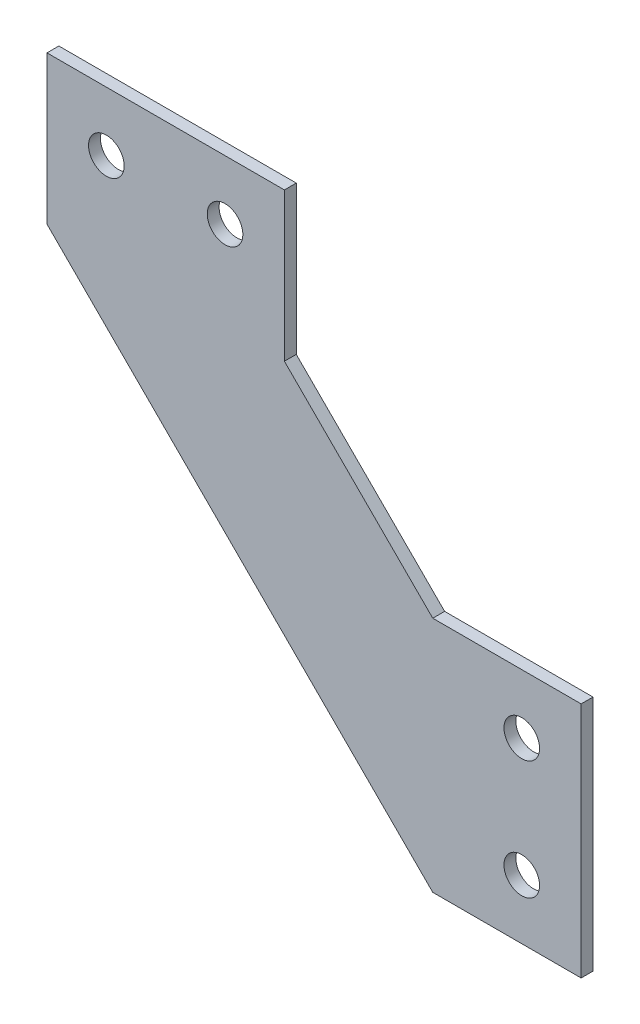
ISO-10303-21;
HEADER;
FILE_DESCRIPTION(('STEP AP214'),'2;1');
FILE_NAME('part.step','',(''),(''),'','','');
FILE_SCHEMA(('AUTOMOTIVE_DESIGN { 1 0 10303 214 1 1 1 1 }'));
ENDSEC;
DATA;
#1=APPLICATION_CONTEXT('core data for automotive mechanical design processes');
#2=APPLICATION_PROTOCOL_DEFINITION('international standard','automotive_design',2000,#1);
#3=PRODUCT_CONTEXT('',#1,'mechanical');
#4=PRODUCT('Part','Part','',(#3));
#5=PRODUCT_RELATED_PRODUCT_CATEGORY('part','',(#4));
#6=PRODUCT_DEFINITION_FORMATION('','',#4);
#7=PRODUCT_DEFINITION_CONTEXT('part definition',#1,'design');
#8=PRODUCT_DEFINITION('design','',#6,#7);
#9=PRODUCT_DEFINITION_SHAPE('','',#8);
#10=(LENGTH_UNIT() NAMED_UNIT(*) SI_UNIT(.MILLI.,.METRE.));
#11=(NAMED_UNIT(*) PLANE_ANGLE_UNIT() SI_UNIT($,.RADIAN.));
#12=(NAMED_UNIT(*) SI_UNIT($,.STERADIAN.) SOLID_ANGLE_UNIT());
#13=UNCERTAINTY_MEASURE_WITH_UNIT(LENGTH_MEASURE(1.E-05),#10,'distance_accuracy_value','');
#14=(GEOMETRIC_REPRESENTATION_CONTEXT(3) GLOBAL_UNCERTAINTY_ASSIGNED_CONTEXT((#13)) GLOBAL_UNIT_ASSIGNED_CONTEXT((#10,
#11,#12)) REPRESENTATION_CONTEXT('',''));
#15=CARTESIAN_POINT('',(0.,0.,0.));
#16=DIRECTION('',(0.,0.,1.));
#17=DIRECTION('',(1.,0.,0.));
#18=AXIS2_PLACEMENT_3D('',#15,#16,#17);
#19=CARTESIAN_POINT('',(0.,-1.7842570444233E-13,57.2993949770653));
#20=DIRECTION('',(0.,0.,-1.));
#21=DIRECTION('',(0.,1.,0.));
#22=AXIS2_PLACEMENT_3D('',#19,#20,#21);
#23=PLANE('',#22);
#24=CARTESIAN_POINT('',(-132.035137501078,-15.4498738995503,57.2993949770652));
#25=DIRECTION('',(0.,0.,-1.));
#26=DIRECTION('',(0.,1.,0.));
#27=AXIS2_PLACEMENT_3D('',#24,#25,#26);
#28=CIRCLE('',#27,3.00000000000005);
#29=CARTESIAN_POINT('',(-132.035137501078,-12.4498738995502,57.2993949770652));
#30=VERTEX_POINT('',#29);
#31=EDGE_CURVE('E192',#30,#30,#28,.T.);
#32=ORIENTED_EDGE('',*,*,#31,.F.);
#33=EDGE_LOOP('',(#32));
#34=FACE_BOUND('',#33,.T.);
#35=CARTESIAN_POINT('',(-202.035137501079,54.5501261004499,57.2993949770655));
#36=DIRECTION('',(0.,0.,-1.));
#37=DIRECTION('',(0.,1.,0.));
#38=AXIS2_PLACEMENT_3D('',#35,#36,#37);
#39=CIRCLE('',#38,2.99999999999628);
#40=CARTESIAN_POINT('',(-202.035137501079,57.5501261004462,57.2993949770655));
#41=VERTEX_POINT('',#40);
#42=EDGE_CURVE('E139',#41,#41,#39,.T.);
#43=ORIENTED_EDGE('',*,*,#42,.F.);
#44=EDGE_LOOP('',(#43));
#45=FACE_BOUND('',#44,.T.);
#46=DIRECTION('',(0.,1.,0.));
#47=VECTOR('',#46,1.);
#48=CARTESIAN_POINT('',(-212.035137501076,64.5501261004493,57.2993949770655));
#49=LINE('',#48,#47);
#50=CARTESIAN_POINT('',(-212.035137501076,39.5501261004506,57.2993949770654));
#51=VERTEX_POINT('',#50);
#52=CARTESIAN_POINT('',(-212.035137501076,64.5501261004493,57.2993949770655));
#53=VERTEX_POINT('',#52);
#54=EDGE_CURVE('E51',#51,#53,#49,.T.);
#55=ORIENTED_EDGE('',*,*,#54,.T.);
#56=DIRECTION('',(1.,0.,0.));
#57=VECTOR('',#56,1.);
#58=CARTESIAN_POINT('',(-212.035137501076,64.5501261004493,57.2993949770655));
#59=LINE('',#58,#57);
#60=CARTESIAN_POINT('',(-172.035137501077,64.5501261004493,57.2993949770655));
#61=VERTEX_POINT('',#60);
#62=EDGE_CURVE('E94',#53,#61,#59,.T.);
#63=ORIENTED_EDGE('',*,*,#62,.T.);
#64=DIRECTION('',(0.,-1.,0.));
#65=VECTOR('',#64,1.);
#66=CARTESIAN_POINT('',(-172.035137501077,64.5501261004493,57.2993949770655));
#67=LINE('',#66,#65);
#68=CARTESIAN_POINT('',(-172.035137501077,39.5501261004506,57.2993949770654));
#69=VERTEX_POINT('',#68);
#70=EDGE_CURVE('E164',#61,#69,#67,.T.);
#71=ORIENTED_EDGE('',*,*,#70,.T.);
#72=DIRECTION('',(0.707106781186529,-0.707106781186566,0.));
#73=VECTOR('',#72,1.);
#74=CARTESIAN_POINT('',(-172.035137501077,39.5501261004506,57.2993949770654));
#75=LINE('',#74,#73);
#76=CARTESIAN_POINT('',(-147.035137501078,14.5501261004497,57.2993949770653));
#77=VERTEX_POINT('',#76);
#78=EDGE_CURVE('E177',#69,#77,#75,.T.);
#79=ORIENTED_EDGE('',*,*,#78,.T.);
#80=DIRECTION('',(1.,0.,0.));
#81=VECTOR('',#80,1.);
#82=CARTESIAN_POINT('',(-147.035137501078,14.5501261004497,57.2993949770653));
#83=LINE('',#82,#81);
#84=CARTESIAN_POINT('',(-122.035137501077,14.5501261004497,57.2993949770653));
#85=VERTEX_POINT('',#84);
#86=EDGE_CURVE('E114',#77,#85,#83,.T.);
#87=ORIENTED_EDGE('',*,*,#86,.T.);
#88=DIRECTION('',(0.,-1.,0.));
#89=VECTOR('',#88,1.);
#90=CARTESIAN_POINT('',(-122.035137501077,-25.4498738995503,57.2993949770652));
#91=LINE('',#90,#89);
#92=CARTESIAN_POINT('',(-122.035137501077,-25.4498738995503,57.2993949770652));
#93=VERTEX_POINT('',#92);
#94=EDGE_CURVE('E108',#85,#93,#91,.T.);
#95=ORIENTED_EDGE('',*,*,#94,.T.);
#96=DIRECTION('',(-1.,0.,0.));
#97=VECTOR('',#96,1.);
#98=CARTESIAN_POINT('',(-122.035137501077,-25.4498738995503,57.2993949770652));
#99=LINE('',#98,#97);
#100=CARTESIAN_POINT('',(-147.035137501078,-25.4498738995503,57.2993949770652));
#101=VERTEX_POINT('',#100);
#102=EDGE_CURVE('E112',#93,#101,#99,.T.);
#103=ORIENTED_EDGE('',*,*,#102,.T.);
#104=DIRECTION('',(-0.70710678118653,0.707106781186565,0.));
#105=VECTOR('',#104,1.);
#106=CARTESIAN_POINT('',(-212.035137501076,39.5501261004506,57.2993949770654));
#107=LINE('',#106,#105);
#108=EDGE_CURVE('E129',#101,#51,#107,.T.);
#109=ORIENTED_EDGE('',*,*,#108,.T.);
#110=EDGE_LOOP('',(#55,#63,#71,#79,#87,#95,#103,#109));
#111=FACE_BOUND('',#110,.T.);
#112=CARTESIAN_POINT('',(-182.035137501078,54.5501261004499,57.2993949770655));
#113=DIRECTION('',(0.,0.,-1.));
#114=DIRECTION('',(0.,1.,0.));
#115=AXIS2_PLACEMENT_3D('',#112,#113,#114);
#116=CIRCLE('',#115,2.99999999999599);
#117=CARTESIAN_POINT('',(-182.035137501078,57.5501261004459,57.2993949770655));
#118=VERTEX_POINT('',#117);
#119=EDGE_CURVE('E186',#118,#118,#116,.T.);
#120=ORIENTED_EDGE('',*,*,#119,.F.);
#121=EDGE_LOOP('',(#120));
#122=FACE_BOUND('',#121,.T.);
#123=CARTESIAN_POINT('',(-132.035137501078,4.5501261004497,57.2993949770653));
#124=DIRECTION('',(0.,0.,-1.));
#125=DIRECTION('',(0.,1.,0.));
#126=AXIS2_PLACEMENT_3D('',#123,#124,#125);
#127=CIRCLE('',#126,2.99999999999999);
#128=CARTESIAN_POINT('',(-132.035137501078,7.55012610044969,57.2993949770653));
#129=VERTEX_POINT('',#128);
#130=EDGE_CURVE('E198',#129,#129,#127,.T.);
#131=ORIENTED_EDGE('',*,*,#130,.F.);
#132=EDGE_LOOP('',(#131));
#133=FACE_BOUND('',#132,.T.);
#134=ADVANCED_FACE('F34',(#34,#45,#111,#122,#133),#23,.T.);
#135=CARTESIAN_POINT('',(0.,-1.85162494640298E-13,59.2993949770653));
#136=DIRECTION('',(0.,0.,-1.));
#137=DIRECTION('',(0.,1.,0.));
#138=AXIS2_PLACEMENT_3D('',#135,#136,#137);
#139=PLANE('',#138);
#140=DIRECTION('',(1.,0.,0.));
#141=VECTOR('',#140,1.);
#142=CARTESIAN_POINT('',(-212.035137501076,64.5501261004493,59.2993949770655));
#143=LINE('',#142,#141);
#144=CARTESIAN_POINT('',(-212.035137501076,64.5501261004493,59.2993949770655));
#145=VERTEX_POINT('',#144);
#146=CARTESIAN_POINT('',(-172.035137501077,64.5501261004493,59.2993949770655));
#147=VERTEX_POINT('',#146);
#148=EDGE_CURVE('E135',#145,#147,#143,.T.);
#149=ORIENTED_EDGE('',*,*,#148,.F.);
#150=DIRECTION('',(0.,1.,0.));
#151=VECTOR('',#150,1.);
#152=CARTESIAN_POINT('',(-212.035137501076,44.5501261004506,59.2993949770654));
#153=LINE('',#152,#151);
#154=CARTESIAN_POINT('',(-212.035137501076,39.5501261004506,59.2993949770654));
#155=VERTEX_POINT('',#154);
#156=EDGE_CURVE('E149',#155,#145,#153,.T.);
#157=ORIENTED_EDGE('',*,*,#156,.F.);
#158=DIRECTION('',(-0.70710678118653,0.707106781186565,0.));
#159=VECTOR('',#158,1.);
#160=CARTESIAN_POINT('',(-212.035137501076,39.5501261004506,59.2993949770654));
#161=LINE('',#160,#159);
#162=CARTESIAN_POINT('',(-147.035137501078,-25.4498738995503,59.2993949770652));
#163=VERTEX_POINT('',#162);
#164=EDGE_CURVE('E87',#163,#155,#161,.T.);
#165=ORIENTED_EDGE('',*,*,#164,.F.);
#166=DIRECTION('',(-1.,0.,0.));
#167=VECTOR('',#166,1.);
#168=CARTESIAN_POINT('',(-142.035137501078,-25.4498738995503,59.2993949770652));
#169=LINE('',#168,#167);
#170=CARTESIAN_POINT('',(-122.035137501077,-25.4498738995503,59.2993949770652));
#171=VERTEX_POINT('',#170);
#172=EDGE_CURVE('E80',#171,#163,#169,.T.);
#173=ORIENTED_EDGE('',*,*,#172,.F.);
#174=DIRECTION('',(0.,-1.,0.));
#175=VECTOR('',#174,1.);
#176=CARTESIAN_POINT('',(-122.035137501077,-25.4498738995503,59.2993949770652));
#177=LINE('',#176,#175);
#178=CARTESIAN_POINT('',(-122.035137501077,14.5501261004497,59.2993949770653));
#179=VERTEX_POINT('',#178);
#180=EDGE_CURVE('E123',#179,#171,#177,.T.);
#181=ORIENTED_EDGE('',*,*,#180,.F.);
#182=DIRECTION('',(1.,0.,0.));
#183=VECTOR('',#182,1.);
#184=CARTESIAN_POINT('',(-122.035137501077,14.5501261004497,59.2993949770653));
#185=LINE('',#184,#183);
#186=CARTESIAN_POINT('',(-147.035137501078,14.5501261004497,59.2993949770653));
#187=VERTEX_POINT('',#186);
#188=EDGE_CURVE('E144',#187,#179,#185,.T.);
#189=ORIENTED_EDGE('',*,*,#188,.F.);
#190=DIRECTION('',(0.707106781186529,-0.707106781186566,0.));
#191=VECTOR('',#190,1.);
#192=CARTESIAN_POINT('',(-172.035137501077,39.5501261004506,59.2993949770654));
#193=LINE('',#192,#191);
#194=CARTESIAN_POINT('',(-172.035137501077,39.5501261004506,59.2993949770654));
#195=VERTEX_POINT('',#194);
#196=EDGE_CURVE('E141',#195,#187,#193,.T.);
#197=ORIENTED_EDGE('',*,*,#196,.F.);
#198=DIRECTION('',(0.,-1.,0.));
#199=VECTOR('',#198,1.);
#200=CARTESIAN_POINT('',(-172.035137501077,44.5501261004506,59.2993949770654));
#201=LINE('',#200,#199);
#202=EDGE_CURVE('E138',#147,#195,#201,.T.);
#203=ORIENTED_EDGE('',*,*,#202,.F.);
#204=EDGE_LOOP('',(#149,#157,#165,#173,#181,#189,#197,#203));
#205=FACE_BOUND('',#204,.T.);
#206=CARTESIAN_POINT('',(-202.035137501079,54.5501261004499,59.2993949770655));
#207=DIRECTION('',(0.,0.,-1.));
#208=DIRECTION('',(0.,1.,0.));
#209=AXIS2_PLACEMENT_3D('',#206,#207,#208);
#210=CIRCLE('',#209,2.99999999999628);
#211=CARTESIAN_POINT('',(-202.035137501079,57.5501261004462,59.2993949770655));
#212=VERTEX_POINT('',#211);
#213=EDGE_CURVE('E183',#212,#212,#210,.T.);
#214=ORIENTED_EDGE('',*,*,#213,.T.);
#215=EDGE_LOOP('',(#214));
#216=FACE_BOUND('',#215,.T.);
#217=CARTESIAN_POINT('',(-182.035137501078,54.5501261004499,59.2993949770655));
#218=DIRECTION('',(0.,0.,-1.));
#219=DIRECTION('',(0.,1.,0.));
#220=AXIS2_PLACEMENT_3D('',#217,#218,#219);
#221=CIRCLE('',#220,2.99999999999599);
#222=CARTESIAN_POINT('',(-182.035137501078,57.5501261004459,59.2993949770655));
#223=VERTEX_POINT('',#222);
#224=EDGE_CURVE('E189',#223,#223,#221,.T.);
#225=ORIENTED_EDGE('',*,*,#224,.T.);
#226=EDGE_LOOP('',(#225));
#227=FACE_BOUND('',#226,.T.);
#228=CARTESIAN_POINT('',(-132.035137501078,-15.4498738995503,59.2993949770652));
#229=DIRECTION('',(0.,0.,-1.));
#230=DIRECTION('',(0.,1.,0.));
#231=AXIS2_PLACEMENT_3D('',#228,#229,#230);
#232=CIRCLE('',#231,3.00000000000005);
#233=CARTESIAN_POINT('',(-132.035137501078,-12.4498738995502,59.2993949770652));
#234=VERTEX_POINT('',#233);
#235=EDGE_CURVE('E195',#234,#234,#232,.T.);
#236=ORIENTED_EDGE('',*,*,#235,.T.);
#237=EDGE_LOOP('',(#236));
#238=FACE_BOUND('',#237,.T.);
#239=CARTESIAN_POINT('',(-132.035137501078,4.55012610044969,59.2993949770653));
#240=DIRECTION('',(0.,0.,-1.));
#241=DIRECTION('',(0.,1.,0.));
#242=AXIS2_PLACEMENT_3D('',#239,#240,#241);
#243=CIRCLE('',#242,2.99999999999999);
#244=CARTESIAN_POINT('',(-132.035137501078,7.55012610044969,59.2993949770653));
#245=VERTEX_POINT('',#244);
#246=EDGE_CURVE('E201',#245,#245,#243,.T.);
#247=ORIENTED_EDGE('',*,*,#246,.T.);
#248=EDGE_LOOP('',(#247));
#249=FACE_BOUND('',#248,.T.);
#250=ADVANCED_FACE('F168',(#205,#216,#227,#238,#249),#139,.F.);
#251=CARTESIAN_POINT('',(-212.035137501076,64.5501261004493,57.2993949770655));
#252=DIRECTION('',(0.,-1.,0.));
#253=DIRECTION('',(0.,0.,-1.));
#254=AXIS2_PLACEMENT_3D('',#251,#252,#253);
#255=PLANE('',#254);
#256=ORIENTED_EDGE('',*,*,#148,.T.);
#257=DIRECTION('',(0.,0.,1.));
#258=VECTOR('',#257,1.);
#259=CARTESIAN_POINT('',(-172.035137501077,64.5501261004493,57.2993949770655));
#260=LINE('',#259,#258);
#261=EDGE_CURVE('E43',#61,#147,#260,.T.);
#262=ORIENTED_EDGE('',*,*,#261,.F.);
#263=ORIENTED_EDGE('',*,*,#62,.F.);
#264=DIRECTION('',(0.,0.,1.));
#265=VECTOR('',#264,1.);
#266=CARTESIAN_POINT('',(-212.035137501076,64.5501261004493,57.2993949770655));
#267=LINE('',#266,#265);
#268=EDGE_CURVE('E11',#53,#145,#267,.T.);
#269=ORIENTED_EDGE('',*,*,#268,.T.);
#270=EDGE_LOOP('',(#256,#262,#263,#269));
#271=FACE_BOUND('',#270,.T.);
#272=ADVANCED_FACE('F36',(#271),#255,.F.);
#273=CARTESIAN_POINT('',(-172.035137501077,44.5501261004506,57.2993949770654));
#274=DIRECTION('',(-1.,0.,0.));
#275=DIRECTION('',(0.,0.,1.));
#276=AXIS2_PLACEMENT_3D('',#273,#274,#275);
#277=PLANE('',#276);
#278=ORIENTED_EDGE('',*,*,#202,.T.);
#279=DIRECTION('',(0.,0.,1.));
#280=VECTOR('',#279,1.);
#281=CARTESIAN_POINT('',(-172.035137501077,39.5501261004506,57.2993949770654));
#282=LINE('',#281,#280);
#283=EDGE_CURVE('E157',#69,#195,#282,.T.);
#284=ORIENTED_EDGE('',*,*,#283,.F.);
#285=ORIENTED_EDGE('',*,*,#70,.F.);
#286=ORIENTED_EDGE('',*,*,#261,.T.);
#287=EDGE_LOOP('',(#278,#284,#285,#286));
#288=FACE_BOUND('',#287,.T.);
#289=ADVANCED_FACE('F162',(#288),#277,.F.);
#290=CARTESIAN_POINT('',(-172.035137501077,39.5501261004506,57.2993949770654));
#291=DIRECTION('',(-0.707106781186566,-0.707106781186529,0.));
#292=DIRECTION('',(0.707106781186529,-0.707106781186566,0.));
#293=AXIS2_PLACEMENT_3D('',#290,#291,#292);
#294=PLANE('',#293);
#295=ORIENTED_EDGE('',*,*,#196,.T.);
#296=DIRECTION('',(0.,0.,1.));
#297=VECTOR('',#296,1.);
#298=CARTESIAN_POINT('',(-147.035137501078,14.5501261004497,57.2993949770653));
#299=LINE('',#298,#297);
#300=EDGE_CURVE('E154',#77,#187,#299,.T.);
#301=ORIENTED_EDGE('',*,*,#300,.F.);
#302=ORIENTED_EDGE('',*,*,#78,.F.);
#303=ORIENTED_EDGE('',*,*,#283,.T.);
#304=EDGE_LOOP('',(#295,#301,#302,#303));
#305=FACE_BOUND('',#304,.T.);
#306=ADVANCED_FACE('F173',(#305),#294,.F.);
#307=CARTESIAN_POINT('',(-122.035137501077,14.5501261004497,57.2993949770653));
#308=DIRECTION('',(0.,-1.,0.));
#309=DIRECTION('',(0.,0.,-1.));
#310=AXIS2_PLACEMENT_3D('',#307,#308,#309);
#311=PLANE('',#310);
#312=ORIENTED_EDGE('',*,*,#188,.T.);
#313=DIRECTION('',(0.,0.,1.));
#314=VECTOR('',#313,1.);
#315=CARTESIAN_POINT('',(-122.035137501077,14.5501261004497,57.2993949770653));
#316=LINE('',#315,#314);
#317=EDGE_CURVE('E124',#85,#179,#316,.T.);
#318=ORIENTED_EDGE('',*,*,#317,.F.);
#319=ORIENTED_EDGE('',*,*,#86,.F.);
#320=ORIENTED_EDGE('',*,*,#300,.T.);
#321=EDGE_LOOP('',(#312,#318,#319,#320));
#322=FACE_BOUND('',#321,.T.);
#323=ADVANCED_FACE('F176',(#322),#311,.F.);
#324=CARTESIAN_POINT('',(-122.035137501077,-25.4498738995503,57.2993949770652));
#325=DIRECTION('',(-1.,0.,0.));
#326=DIRECTION('',(0.,0.,1.));
#327=AXIS2_PLACEMENT_3D('',#324,#325,#326);
#328=PLANE('',#327);
#329=ORIENTED_EDGE('',*,*,#180,.T.);
#330=DIRECTION('',(0.,0.,1.));
#331=VECTOR('',#330,1.);
#332=CARTESIAN_POINT('',(-122.035137501077,-25.4498738995503,57.2993949770652));
#333=LINE('',#332,#331);
#334=EDGE_CURVE('E120',#93,#171,#333,.T.);
#335=ORIENTED_EDGE('',*,*,#334,.F.);
#336=ORIENTED_EDGE('',*,*,#94,.F.);
#337=ORIENTED_EDGE('',*,*,#317,.T.);
#338=EDGE_LOOP('',(#329,#335,#336,#337));
#339=FACE_BOUND('',#338,.T.);
#340=ADVANCED_FACE('F121',(#339),#328,.F.);
#341=CARTESIAN_POINT('',(-142.035137501078,-25.4498738995503,57.2993949770652));
#342=DIRECTION('',(0.,1.,0.));
#343=DIRECTION('',(0.,0.,1.));
#344=AXIS2_PLACEMENT_3D('',#341,#342,#343);
#345=PLANE('',#344);
#346=ORIENTED_EDGE('',*,*,#172,.T.);
#347=DIRECTION('',(0.,0.,1.));
#348=VECTOR('',#347,1.);
#349=CARTESIAN_POINT('',(-147.035137501078,-25.4498738995503,57.2993949770652));
#350=LINE('',#349,#348);
#351=EDGE_CURVE('E125',#101,#163,#350,.T.);
#352=ORIENTED_EDGE('',*,*,#351,.F.);
#353=ORIENTED_EDGE('',*,*,#102,.F.);
#354=ORIENTED_EDGE('',*,*,#334,.T.);
#355=EDGE_LOOP('',(#346,#352,#353,#354));
#356=FACE_BOUND('',#355,.T.);
#357=ADVANCED_FACE('F127',(#356),#345,.F.);
#358=CARTESIAN_POINT('',(-212.035137501076,39.5501261004506,57.2993949770654));
#359=DIRECTION('',(0.707106781186565,0.70710678118653,0.));
#360=DIRECTION('',(-0.70710678118653,0.707106781186565,0.));
#361=AXIS2_PLACEMENT_3D('',#358,#359,#360);
#362=PLANE('',#361);
#363=ORIENTED_EDGE('',*,*,#164,.T.);
#364=DIRECTION('',(0.,0.,1.));
#365=VECTOR('',#364,1.);
#366=CARTESIAN_POINT('',(-212.035137501076,39.5501261004506,57.2993949770654));
#367=LINE('',#366,#365);
#368=EDGE_CURVE('E131',#51,#155,#367,.T.);
#369=ORIENTED_EDGE('',*,*,#368,.F.);
#370=ORIENTED_EDGE('',*,*,#108,.F.);
#371=ORIENTED_EDGE('',*,*,#351,.T.);
#372=EDGE_LOOP('',(#363,#369,#370,#371));
#373=FACE_BOUND('',#372,.T.);
#374=ADVANCED_FACE('F226',(#373),#362,.F.);
#375=CARTESIAN_POINT('',(-212.035137501076,44.5501261004506,57.2993949770654));
#376=DIRECTION('',(1.,0.,0.));
#377=DIRECTION('',(0.,0.,-1.));
#378=AXIS2_PLACEMENT_3D('',#375,#376,#377);
#379=PLANE('',#378);
#380=ORIENTED_EDGE('',*,*,#156,.T.);
#381=ORIENTED_EDGE('',*,*,#268,.F.);
#382=ORIENTED_EDGE('',*,*,#54,.F.);
#383=ORIENTED_EDGE('',*,*,#368,.T.);
#384=EDGE_LOOP('',(#380,#381,#382,#383));
#385=FACE_BOUND('',#384,.T.);
#386=ADVANCED_FACE('F223',(#385),#379,.F.);
#387=CARTESIAN_POINT('',(-202.035137501079,54.5501261004499,57.2993949770655));
#388=DIRECTION('',(0.,0.,1.));
#389=DIRECTION('',(0.,-1.,0.));
#390=AXIS2_PLACEMENT_3D('',#387,#388,#389);
#391=CYLINDRICAL_SURFACE('',#390,2.99999999999628);
#392=ORIENTED_EDGE('',*,*,#42,.T.);
#393=EDGE_LOOP('',(#392));
#394=FACE_BOUND('',#393,.T.);
#395=ORIENTED_EDGE('',*,*,#213,.F.);
#396=EDGE_LOOP('',(#395));
#397=FACE_BOUND('',#396,.T.);
#398=ADVANCED_FACE('F220',(#394,#397),#391,.F.);
#399=CARTESIAN_POINT('',(-182.035137501078,54.5501261004499,57.2993949770655));
#400=DIRECTION('',(0.,0.,1.));
#401=DIRECTION('',(0.,-1.,0.));
#402=AXIS2_PLACEMENT_3D('',#399,#400,#401);
#403=CYLINDRICAL_SURFACE('',#402,2.99999999999599);
#404=ORIENTED_EDGE('',*,*,#119,.T.);
#405=EDGE_LOOP('',(#404));
#406=FACE_BOUND('',#405,.T.);
#407=ORIENTED_EDGE('',*,*,#224,.F.);
#408=EDGE_LOOP('',(#407));
#409=FACE_BOUND('',#408,.T.);
#410=ADVANCED_FACE('F308',(#406,#409),#403,.F.);
#411=CARTESIAN_POINT('',(-132.035137501078,-15.4498738995503,57.2993949770652));
#412=DIRECTION('',(0.,0.,1.));
#413=DIRECTION('',(0.,-1.,0.));
#414=AXIS2_PLACEMENT_3D('',#411,#412,#413);
#415=CYLINDRICAL_SURFACE('',#414,3.00000000000005);
#416=ORIENTED_EDGE('',*,*,#31,.T.);
#417=EDGE_LOOP('',(#416));
#418=FACE_BOUND('',#417,.T.);
#419=ORIENTED_EDGE('',*,*,#235,.F.);
#420=EDGE_LOOP('',(#419));
#421=FACE_BOUND('',#420,.T.);
#422=ADVANCED_FACE('F316',(#418,#421),#415,.F.);
#423=CARTESIAN_POINT('',(-132.035137501078,4.5501261004497,57.2993949770653));
#424=DIRECTION('',(0.,0.,1.));
#425=DIRECTION('',(0.,-1.,0.));
#426=AXIS2_PLACEMENT_3D('',#423,#424,#425);
#427=CYLINDRICAL_SURFACE('',#426,2.99999999999999);
#428=ORIENTED_EDGE('',*,*,#130,.T.);
#429=EDGE_LOOP('',(#428));
#430=FACE_BOUND('',#429,.T.);
#431=ORIENTED_EDGE('',*,*,#246,.F.);
#432=EDGE_LOOP('',(#431));
#433=FACE_BOUND('',#432,.T.);
#434=ADVANCED_FACE('F207',(#430,#433),#427,.F.);
#435=CLOSED_SHELL('',(#134,#250,#272,#289,#306,#323,#340,#357,#374,#386,#398,#410,#422,#434));
#436=MANIFOLD_SOLID_BREP('B2',#435);
#437=ADVANCED_BREP_SHAPE_REPRESENTATION('',(#18,#436),#14);
#438=SHAPE_DEFINITION_REPRESENTATION(#9,#437);
ENDSEC;
END-ISO-10303-21;
